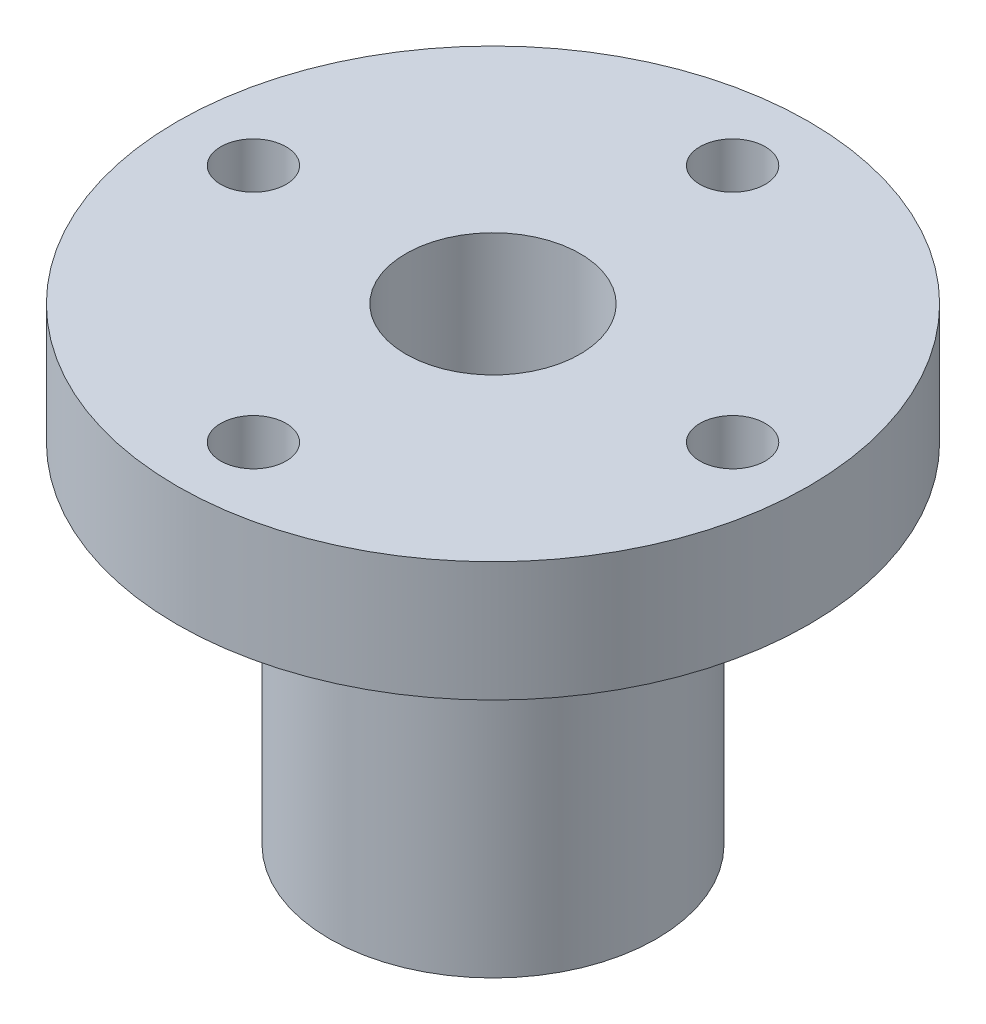
ISO-10303-21;
HEADER;
FILE_DESCRIPTION(('STEP AP214'),'2;1');
FILE_NAME('part.step','',(''),(''),'','','');
FILE_SCHEMA(('AUTOMOTIVE_DESIGN { 1 0 10303 214 1 1 1 1 }'));
ENDSEC;
DATA;
#1=APPLICATION_CONTEXT('core data for automotive mechanical design processes');
#2=APPLICATION_PROTOCOL_DEFINITION('international standard','automotive_design',2000,#1);
#3=PRODUCT_CONTEXT('',#1,'mechanical');
#4=PRODUCT('Part','Part','',(#3));
#5=PRODUCT_RELATED_PRODUCT_CATEGORY('part','',(#4));
#6=PRODUCT_DEFINITION_FORMATION('','',#4);
#7=PRODUCT_DEFINITION_CONTEXT('part definition',#1,'design');
#8=PRODUCT_DEFINITION('design','',#6,#7);
#9=PRODUCT_DEFINITION_SHAPE('','',#8);
#10=(LENGTH_UNIT() NAMED_UNIT(*) SI_UNIT(.MILLI.,.METRE.));
#11=(NAMED_UNIT(*) PLANE_ANGLE_UNIT() SI_UNIT($,.RADIAN.));
#12=(NAMED_UNIT(*) SI_UNIT($,.STERADIAN.) SOLID_ANGLE_UNIT());
#13=UNCERTAINTY_MEASURE_WITH_UNIT(LENGTH_MEASURE(1.E-05),#10,'distance_accuracy_value','');
#14=(GEOMETRIC_REPRESENTATION_CONTEXT(3) GLOBAL_UNCERTAINTY_ASSIGNED_CONTEXT((#13)) GLOBAL_UNIT_ASSIGNED_CONTEXT((#10,
#11,#12)) REPRESENTATION_CONTEXT('',''));
#15=CARTESIAN_POINT('',(0.,0.,0.));
#16=DIRECTION('',(0.,0.,1.));
#17=DIRECTION('',(1.,0.,0.));
#18=AXIS2_PLACEMENT_3D('',#15,#16,#17);
#19=CARTESIAN_POINT('',(0.,16.,0.));
#20=DIRECTION('',(0.,-1.,0.));
#21=DIRECTION('',(0.,0.,-1.));
#22=AXIS2_PLACEMENT_3D('',#19,#20,#21);
#23=CYLINDRICAL_SURFACE('',#22,7.5);
#24=CARTESIAN_POINT('',(0.,0.,0.));
#25=DIRECTION('',(0.,1.,0.));
#26=DIRECTION('',(0.,0.,1.));
#27=AXIS2_PLACEMENT_3D('',#24,#25,#26);
#28=CIRCLE('',#27,7.5);
#29=CARTESIAN_POINT('',(0.,0.,7.5));
#30=VERTEX_POINT('',#29);
#31=EDGE_CURVE('E46',#30,#30,#28,.T.);
#32=ORIENTED_EDGE('',*,*,#31,.T.);
#33=EDGE_LOOP('',(#32));
#34=FACE_BOUND('',#33,.T.);
#35=CARTESIAN_POINT('',(0.,16.,0.));
#36=DIRECTION('',(0.,1.,0.));
#37=DIRECTION('',(0.,0.,1.));
#38=AXIS2_PLACEMENT_3D('',#35,#36,#37);
#39=CIRCLE('',#38,7.5);
#40=CARTESIAN_POINT('',(0.,16.,7.5));
#41=VERTEX_POINT('',#40);
#42=EDGE_CURVE('E10',#41,#41,#39,.T.);
#43=ORIENTED_EDGE('',*,*,#42,.F.);
#44=EDGE_LOOP('',(#43));
#45=FACE_BOUND('',#44,.T.);
#46=ADVANCED_FACE('F40',(#34,#45),#23,.T.);
#47=CARTESIAN_POINT('',(0.,0.,0.));
#48=DIRECTION('',(0.,1.,0.));
#49=DIRECTION('',(0.,0.,1.));
#50=AXIS2_PLACEMENT_3D('',#47,#48,#49);
#51=PLANE('',#50);
#52=ORIENTED_EDGE('',*,*,#31,.F.);
#53=EDGE_LOOP('',(#52));
#54=FACE_BOUND('',#53,.T.);
#55=CARTESIAN_POINT('',(0.,0.,0.));
#56=DIRECTION('',(0.,1.,0.));
#57=DIRECTION('',(0.,0.,1.));
#58=AXIS2_PLACEMENT_3D('',#55,#56,#57);
#59=CIRCLE('',#58,4.);
#60=CARTESIAN_POINT('',(0.,0.,4.));
#61=VERTEX_POINT('',#60);
#62=EDGE_CURVE('E50',#61,#61,#59,.T.);
#63=ORIENTED_EDGE('',*,*,#62,.T.);
#64=EDGE_LOOP('',(#63));
#65=FACE_BOUND('',#64,.T.);
#66=ADVANCED_FACE('F131',(#54,#65),#51,.F.);
#67=CARTESIAN_POINT('',(0.,16.,0.));
#68=DIRECTION('',(0.,-1.,0.));
#69=DIRECTION('',(0.,0.,-1.));
#70=AXIS2_PLACEMENT_3D('',#67,#68,#69);
#71=CYLINDRICAL_SURFACE('',#70,4.);
#72=ORIENTED_EDGE('',*,*,#62,.F.);
#73=EDGE_LOOP('',(#72));
#74=FACE_BOUND('',#73,.T.);
#75=CARTESIAN_POINT('',(0.,21.5,0.));
#76=DIRECTION('',(0.,1.,0.));
#77=DIRECTION('',(0.,0.,1.));
#78=AXIS2_PLACEMENT_3D('',#75,#76,#77);
#79=CIRCLE('',#78,4.);
#80=CARTESIAN_POINT('',(0.,21.5,4.));
#81=VERTEX_POINT('',#80);
#82=EDGE_CURVE('E54',#81,#81,#79,.T.);
#83=ORIENTED_EDGE('',*,*,#82,.T.);
#84=EDGE_LOOP('',(#83));
#85=FACE_BOUND('',#84,.T.);
#86=ADVANCED_FACE('F104',(#74,#85),#71,.F.);
#87=CARTESIAN_POINT('',(0.,21.5,0.));
#88=DIRECTION('',(0.,1.,0.));
#89=DIRECTION('',(0.,0.,1.));
#90=AXIS2_PLACEMENT_3D('',#87,#88,#89);
#91=PLANE('',#90);
#92=CARTESIAN_POINT('',(11.0000000000003,21.5,-3.10618136515851E-13));
#93=DIRECTION('',(0.,1.,0.));
#94=DIRECTION('',(0.,0.,1.));
#95=AXIS2_PLACEMENT_3D('',#92,#93,#94);
#96=CIRCLE('',#95,1.50000000000024);
#97=CARTESIAN_POINT('',(11.0000000000003,21.5,1.49999999999993));
#98=VERTEX_POINT('',#97);
#99=EDGE_CURVE('E84',#98,#98,#96,.T.);
#100=ORIENTED_EDGE('',*,*,#99,.F.);
#101=EDGE_LOOP('',(#100));
#102=FACE_BOUND('',#101,.T.);
#103=CARTESIAN_POINT('',(0.,21.5,11.));
#104=DIRECTION('',(0.,1.,0.));
#105=DIRECTION('',(0.,0.,1.));
#106=AXIS2_PLACEMENT_3D('',#103,#104,#105);
#107=CIRCLE('',#106,1.5);
#108=CARTESIAN_POINT('',(0.,21.5,12.5));
#109=VERTEX_POINT('',#108);
#110=EDGE_CURVE('E78',#109,#109,#107,.T.);
#111=ORIENTED_EDGE('',*,*,#110,.F.);
#112=EDGE_LOOP('',(#111));
#113=FACE_BOUND('',#112,.T.);
#114=CARTESIAN_POINT('',(-10.9999999999997,21.5,3.11965247994913E-13));
#115=DIRECTION('',(0.,1.,0.));
#116=DIRECTION('',(0.,0.,1.));
#117=AXIS2_PLACEMENT_3D('',#114,#115,#116);
#118=CIRCLE('',#117,1.5000000000005);
#119=CARTESIAN_POINT('',(-10.9999999999997,21.5,1.50000000000081));
#120=VERTEX_POINT('',#119);
#121=EDGE_CURVE('E72',#120,#120,#118,.T.);
#122=ORIENTED_EDGE('',*,*,#121,.F.);
#123=EDGE_LOOP('',(#122));
#124=FACE_BOUND('',#123,.T.);
#125=CARTESIAN_POINT('',(0.,21.5,-11.));
#126=DIRECTION('',(0.,1.,0.));
#127=DIRECTION('',(0.,0.,1.));
#128=AXIS2_PLACEMENT_3D('',#125,#126,#127);
#129=CIRCLE('',#128,1.5);
#130=CARTESIAN_POINT('',(0.,21.5,-9.5));
#131=VERTEX_POINT('',#130);
#132=EDGE_CURVE('E66',#131,#131,#129,.T.);
#133=ORIENTED_EDGE('',*,*,#132,.F.);
#134=EDGE_LOOP('',(#133));
#135=FACE_BOUND('',#134,.T.);
#136=ORIENTED_EDGE('',*,*,#82,.F.);
#137=EDGE_LOOP('',(#136));
#138=FACE_BOUND('',#137,.T.);
#139=CARTESIAN_POINT('',(0.,21.5,0.));
#140=DIRECTION('',(0.,1.,0.));
#141=DIRECTION('',(0.,0.,1.));
#142=AXIS2_PLACEMENT_3D('',#139,#140,#141);
#143=CIRCLE('',#142,14.5);
#144=CARTESIAN_POINT('',(0.,21.5,14.5));
#145=VERTEX_POINT('',#144);
#146=EDGE_CURVE('E59',#145,#145,#143,.T.);
#147=ORIENTED_EDGE('',*,*,#146,.T.);
#148=EDGE_LOOP('',(#147));
#149=FACE_BOUND('',#148,.T.);
#150=ADVANCED_FACE('F100',(#102,#113,#124,#135,#138,#149),#91,.T.);
#151=CARTESIAN_POINT('',(0.,21.5,0.));
#152=DIRECTION('',(0.,-1.,0.));
#153=DIRECTION('',(0.,0.,-1.));
#154=AXIS2_PLACEMENT_3D('',#151,#152,#153);
#155=CYLINDRICAL_SURFACE('',#154,14.5);
#156=ORIENTED_EDGE('',*,*,#146,.F.);
#157=EDGE_LOOP('',(#156));
#158=FACE_BOUND('',#157,.T.);
#159=CARTESIAN_POINT('',(0.,16.,0.));
#160=DIRECTION('',(0.,1.,0.));
#161=DIRECTION('',(0.,0.,1.));
#162=AXIS2_PLACEMENT_3D('',#159,#160,#161);
#163=CIRCLE('',#162,14.5);
#164=CARTESIAN_POINT('',(0.,16.,14.5));
#165=VERTEX_POINT('',#164);
#166=EDGE_CURVE('E60',#165,#165,#163,.T.);
#167=ORIENTED_EDGE('',*,*,#166,.T.);
#168=EDGE_LOOP('',(#167));
#169=FACE_BOUND('',#168,.T.);
#170=ADVANCED_FACE('F103',(#158,#169),#155,.T.);
#171=CARTESIAN_POINT('',(0.,16.,0.));
#172=DIRECTION('',(0.,1.,0.));
#173=DIRECTION('',(0.,0.,1.));
#174=AXIS2_PLACEMENT_3D('',#171,#172,#173);
#175=PLANE('',#174);
#176=CARTESIAN_POINT('',(11.0000000000003,16.,-3.10618136515851E-13));
#177=DIRECTION('',(0.,1.,0.));
#178=DIRECTION('',(0.,0.,1.));
#179=AXIS2_PLACEMENT_3D('',#176,#177,#178);
#180=CIRCLE('',#179,1.50000000000024);
#181=CARTESIAN_POINT('',(11.0000000000003,16.,1.49999999999993));
#182=VERTEX_POINT('',#181);
#183=EDGE_CURVE('E63',#182,#182,#180,.T.);
#184=ORIENTED_EDGE('',*,*,#183,.T.);
#185=EDGE_LOOP('',(#184));
#186=FACE_BOUND('',#185,.T.);
#187=CARTESIAN_POINT('',(0.,16.,11.));
#188=DIRECTION('',(0.,1.,0.));
#189=DIRECTION('',(0.,0.,1.));
#190=AXIS2_PLACEMENT_3D('',#187,#188,#189);
#191=CIRCLE('',#190,1.5);
#192=CARTESIAN_POINT('',(0.,16.,12.5));
#193=VERTEX_POINT('',#192);
#194=EDGE_CURVE('E81',#193,#193,#191,.T.);
#195=ORIENTED_EDGE('',*,*,#194,.T.);
#196=EDGE_LOOP('',(#195));
#197=FACE_BOUND('',#196,.T.);
#198=CARTESIAN_POINT('',(-10.9999999999997,16.,3.11965247994913E-13));
#199=DIRECTION('',(0.,1.,0.));
#200=DIRECTION('',(0.,0.,1.));
#201=AXIS2_PLACEMENT_3D('',#198,#199,#200);
#202=CIRCLE('',#201,1.5000000000005);
#203=CARTESIAN_POINT('',(-10.9999999999997,16.,1.50000000000081));
#204=VERTEX_POINT('',#203);
#205=EDGE_CURVE('E75',#204,#204,#202,.T.);
#206=ORIENTED_EDGE('',*,*,#205,.T.);
#207=EDGE_LOOP('',(#206));
#208=FACE_BOUND('',#207,.T.);
#209=CARTESIAN_POINT('',(0.,16.,-11.));
#210=DIRECTION('',(0.,1.,0.));
#211=DIRECTION('',(0.,0.,1.));
#212=AXIS2_PLACEMENT_3D('',#209,#210,#211);
#213=CIRCLE('',#212,1.5);
#214=CARTESIAN_POINT('',(0.,16.,-9.5));
#215=VERTEX_POINT('',#214);
#216=EDGE_CURVE('E69',#215,#215,#213,.T.);
#217=ORIENTED_EDGE('',*,*,#216,.T.);
#218=EDGE_LOOP('',(#217));
#219=FACE_BOUND('',#218,.T.);
#220=ORIENTED_EDGE('',*,*,#42,.T.);
#221=EDGE_LOOP('',(#220));
#222=FACE_BOUND('',#221,.T.);
#223=ORIENTED_EDGE('',*,*,#166,.F.);
#224=EDGE_LOOP('',(#223));
#225=FACE_BOUND('',#224,.T.);
#226=ADVANCED_FACE('F90',(#186,#197,#208,#219,#222,#225),#175,.F.);
#227=CARTESIAN_POINT('',(0.,16.,-11.));
#228=DIRECTION('',(0.,1.,0.));
#229=DIRECTION('',(0.,0.,1.));
#230=AXIS2_PLACEMENT_3D('',#227,#228,#229);
#231=CYLINDRICAL_SURFACE('',#230,1.5);
#232=ORIENTED_EDGE('',*,*,#216,.F.);
#233=EDGE_LOOP('',(#232));
#234=FACE_BOUND('',#233,.T.);
#235=ORIENTED_EDGE('',*,*,#132,.T.);
#236=EDGE_LOOP('',(#235));
#237=FACE_BOUND('',#236,.T.);
#238=ADVANCED_FACE('F122',(#234,#237),#231,.F.);
#239=CARTESIAN_POINT('',(-10.9999999999997,16.,3.11965247994913E-13));
#240=DIRECTION('',(0.,1.,0.));
#241=DIRECTION('',(0.,0.,1.));
#242=AXIS2_PLACEMENT_3D('',#239,#240,#241);
#243=CYLINDRICAL_SURFACE('',#242,1.5000000000005);
#244=ORIENTED_EDGE('',*,*,#205,.F.);
#245=EDGE_LOOP('',(#244));
#246=FACE_BOUND('',#245,.T.);
#247=ORIENTED_EDGE('',*,*,#121,.T.);
#248=EDGE_LOOP('',(#247));
#249=FACE_BOUND('',#248,.T.);
#250=ADVANCED_FACE('F127',(#246,#249),#243,.F.);
#251=CARTESIAN_POINT('',(0.,16.,11.));
#252=DIRECTION('',(0.,1.,0.));
#253=DIRECTION('',(0.,0.,1.));
#254=AXIS2_PLACEMENT_3D('',#251,#252,#253);
#255=CYLINDRICAL_SURFACE('',#254,1.5);
#256=ORIENTED_EDGE('',*,*,#194,.F.);
#257=EDGE_LOOP('',(#256));
#258=FACE_BOUND('',#257,.T.);
#259=ORIENTED_EDGE('',*,*,#110,.T.);
#260=EDGE_LOOP('',(#259));
#261=FACE_BOUND('',#260,.T.);
#262=ADVANCED_FACE('F96',(#258,#261),#255,.F.);
#263=CARTESIAN_POINT('',(11.0000000000003,16.,-3.10618136515851E-13));
#264=DIRECTION('',(0.,1.,0.));
#265=DIRECTION('',(0.,0.,1.));
#266=AXIS2_PLACEMENT_3D('',#263,#264,#265);
#267=CYLINDRICAL_SURFACE('',#266,1.50000000000024);
#268=ORIENTED_EDGE('',*,*,#183,.F.);
#269=EDGE_LOOP('',(#268));
#270=FACE_BOUND('',#269,.T.);
#271=ORIENTED_EDGE('',*,*,#99,.T.);
#272=EDGE_LOOP('',(#271));
#273=FACE_BOUND('',#272,.T.);
#274=ADVANCED_FACE('F93',(#270,#273),#267,.F.);
#275=CLOSED_SHELL('',(#46,#66,#86,#150,#170,#226,#238,#250,#262,#274));
#276=MANIFOLD_SOLID_BREP('B2',#275);
#277=ADVANCED_BREP_SHAPE_REPRESENTATION('',(#18,#276),#14);
#278=SHAPE_DEFINITION_REPRESENTATION(#9,#277);
ENDSEC;
END-ISO-10303-21;
